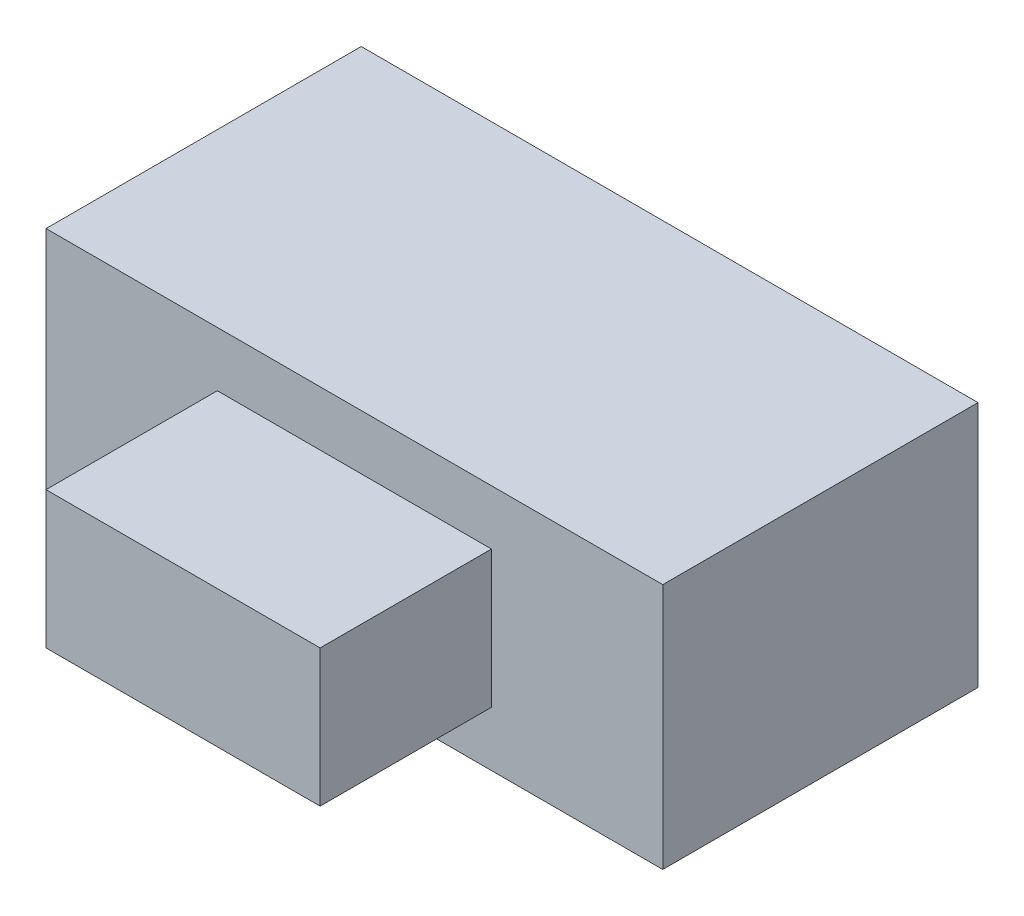
ISO-10303-21;
HEADER;
FILE_DESCRIPTION(('STEP AP214'),'2;1');
FILE_NAME('part.step','',(''),(''),'','','');
FILE_SCHEMA(('AUTOMOTIVE_DESIGN { 1 0 10303 214 1 1 1 1 }'));
ENDSEC;
DATA;
#1=APPLICATION_CONTEXT('core data for automotive mechanical design processes');
#2=APPLICATION_PROTOCOL_DEFINITION('international standard','automotive_design',2000,#1);
#3=PRODUCT_CONTEXT('',#1,'mechanical');
#4=PRODUCT('Part','Part','',(#3));
#5=PRODUCT_RELATED_PRODUCT_CATEGORY('part','',(#4));
#6=PRODUCT_DEFINITION_FORMATION('','',#4);
#7=PRODUCT_DEFINITION_CONTEXT('part definition',#1,'design');
#8=PRODUCT_DEFINITION('design','',#6,#7);
#9=PRODUCT_DEFINITION_SHAPE('','',#8);
#10=(LENGTH_UNIT() NAMED_UNIT(*) SI_UNIT(.MILLI.,.METRE.));
#11=(NAMED_UNIT(*) PLANE_ANGLE_UNIT() SI_UNIT($,.RADIAN.));
#12=(NAMED_UNIT(*) SI_UNIT($,.STERADIAN.) SOLID_ANGLE_UNIT());
#13=UNCERTAINTY_MEASURE_WITH_UNIT(LENGTH_MEASURE(1.E-05),#10,'distance_accuracy_value','');
#14=(GEOMETRIC_REPRESENTATION_CONTEXT(3) GLOBAL_UNCERTAINTY_ASSIGNED_CONTEXT((#13)) GLOBAL_UNIT_ASSIGNED_CONTEXT((#10,
#11,#12)) REPRESENTATION_CONTEXT('',''));
#15=CARTESIAN_POINT('',(0.,0.,0.));
#16=DIRECTION('',(0.,0.,1.));
#17=DIRECTION('',(1.,0.,0.));
#18=AXIS2_PLACEMENT_3D('',#15,#16,#17);
#19=CARTESIAN_POINT('',(2.25,1.8,1.15));
#20=DIRECTION('',(0.,0.,-1.));
#21=DIRECTION('',(-1.,0.,0.));
#22=AXIS2_PLACEMENT_3D('',#19,#20,#21);
#23=PLANE('',#22);
#24=DIRECTION('',(1.,0.,0.));
#25=VECTOR('',#24,1.);
#26=CARTESIAN_POINT('',(2.25,0.,1.15));
#27=LINE('',#26,#25);
#28=CARTESIAN_POINT('',(-2.25,0.,1.15));
#29=VERTEX_POINT('',#28);
#30=CARTESIAN_POINT('',(2.25,0.,1.15));
#31=VERTEX_POINT('',#30);
#32=EDGE_CURVE('E122',#29,#31,#27,.T.);
#33=ORIENTED_EDGE('',*,*,#32,.T.);
#34=DIRECTION('',(0.,-1.,0.));
#35=VECTOR('',#34,1.);
#36=CARTESIAN_POINT('',(2.25,1.8,1.15));
#37=LINE('',#36,#35);
#38=CARTESIAN_POINT('',(2.25,1.8,1.15));
#39=VERTEX_POINT('',#38);
#40=EDGE_CURVE('E41',#39,#31,#37,.T.);
#41=ORIENTED_EDGE('',*,*,#40,.F.);
#42=DIRECTION('',(1.,0.,0.));
#43=VECTOR('',#42,1.);
#44=CARTESIAN_POINT('',(2.25,1.8,1.15));
#45=LINE('',#44,#43);
#46=CARTESIAN_POINT('',(-2.25,1.8,1.15));
#47=VERTEX_POINT('',#46);
#48=EDGE_CURVE('E131',#47,#39,#45,.T.);
#49=ORIENTED_EDGE('',*,*,#48,.F.);
#50=DIRECTION('',(0.,-1.,0.));
#51=VECTOR('',#50,1.);
#52=CARTESIAN_POINT('',(-2.25,1.8,1.15));
#53=LINE('',#52,#51);
#54=EDGE_CURVE('E11',#47,#29,#53,.T.);
#55=ORIENTED_EDGE('',*,*,#54,.T.);
#56=EDGE_LOOP('',(#33,#41,#49,#55));
#57=FACE_BOUND('',#56,.T.);
#58=DIRECTION('',(0.,-1.,0.));
#59=VECTOR('',#58,1.);
#60=CARTESIAN_POINT('',(-1.,0.4,1.15));
#61=LINE('',#60,#59);
#62=CARTESIAN_POINT('',(-1.,1.4,1.15));
#63=VERTEX_POINT('',#62);
#64=CARTESIAN_POINT('',(-1.,0.4,1.15));
#65=VERTEX_POINT('',#64);
#66=EDGE_CURVE('E118',#63,#65,#61,.T.);
#67=ORIENTED_EDGE('',*,*,#66,.F.);
#68=DIRECTION('',(-1.,0.,0.));
#69=VECTOR('',#68,1.);
#70=CARTESIAN_POINT('',(1.,1.4,1.15));
#71=LINE('',#70,#69);
#72=CARTESIAN_POINT('',(1.,1.4,1.15));
#73=VERTEX_POINT('',#72);
#74=EDGE_CURVE('E115',#73,#63,#71,.T.);
#75=ORIENTED_EDGE('',*,*,#74,.F.);
#76=DIRECTION('',(0.,1.,0.));
#77=VECTOR('',#76,1.);
#78=CARTESIAN_POINT('',(1.,0.4,1.15));
#79=LINE('',#78,#77);
#80=CARTESIAN_POINT('',(1.,0.4,1.15));
#81=VERTEX_POINT('',#80);
#82=EDGE_CURVE('E53',#81,#73,#79,.T.);
#83=ORIENTED_EDGE('',*,*,#82,.F.);
#84=DIRECTION('',(1.,0.,0.));
#85=VECTOR('',#84,1.);
#86=CARTESIAN_POINT('',(1.,0.4,1.15));
#87=LINE('',#86,#85);
#88=EDGE_CURVE('E48',#65,#81,#87,.T.);
#89=ORIENTED_EDGE('',*,*,#88,.F.);
#90=EDGE_LOOP('',(#67,#75,#83,#89));
#91=FACE_BOUND('',#90,.T.);
#92=ADVANCED_FACE('F33',(#57,#91),#23,.F.);
#93=CARTESIAN_POINT('',(-2.25,1.8,-1.15));
#94=DIRECTION('',(1.,0.,0.));
#95=DIRECTION('',(0.,0.,-1.));
#96=AXIS2_PLACEMENT_3D('',#93,#94,#95);
#97=PLANE('',#96);
#98=DIRECTION('',(0.,0.,1.));
#99=VECTOR('',#98,1.);
#100=CARTESIAN_POINT('',(-2.25,0.,-1.15));
#101=LINE('',#100,#99);
#102=CARTESIAN_POINT('',(-2.25,0.,-1.15));
#103=VERTEX_POINT('',#102);
#104=EDGE_CURVE('E119',#103,#29,#101,.T.);
#105=ORIENTED_EDGE('',*,*,#104,.T.);
#106=ORIENTED_EDGE('',*,*,#54,.F.);
#107=DIRECTION('',(0.,0.,1.));
#108=VECTOR('',#107,1.);
#109=CARTESIAN_POINT('',(-2.25,1.8,-1.15));
#110=LINE('',#109,#108);
#111=CARTESIAN_POINT('',(-2.25,1.8,-1.15));
#112=VERTEX_POINT('',#111);
#113=EDGE_CURVE('E128',#112,#47,#110,.T.);
#114=ORIENTED_EDGE('',*,*,#113,.F.);
#115=DIRECTION('',(0.,-1.,0.));
#116=VECTOR('',#115,1.);
#117=CARTESIAN_POINT('',(-2.25,1.8,-1.15));
#118=LINE('',#117,#116);
#119=EDGE_CURVE('E137',#112,#103,#118,.T.);
#120=ORIENTED_EDGE('',*,*,#119,.T.);
#121=EDGE_LOOP('',(#105,#106,#114,#120));
#122=FACE_BOUND('',#121,.T.);
#123=ADVANCED_FACE('F35',(#122),#97,.F.);
#124=CARTESIAN_POINT('',(2.25,1.8,-1.15));
#125=DIRECTION('',(-1.,0.,0.));
#126=DIRECTION('',(0.,0.,1.));
#127=AXIS2_PLACEMENT_3D('',#124,#125,#126);
#128=PLANE('',#127);
#129=DIRECTION('',(0.,0.,-1.));
#130=VECTOR('',#129,1.);
#131=CARTESIAN_POINT('',(2.25,0.,-1.15));
#132=LINE('',#131,#130);
#133=CARTESIAN_POINT('',(2.25,0.,-1.15));
#134=VERTEX_POINT('',#133);
#135=EDGE_CURVE('E140',#31,#134,#132,.T.);
#136=ORIENTED_EDGE('',*,*,#135,.T.);
#137=DIRECTION('',(0.,-1.,0.));
#138=VECTOR('',#137,1.);
#139=CARTESIAN_POINT('',(2.25,1.8,-1.15));
#140=LINE('',#139,#138);
#141=CARTESIAN_POINT('',(2.25,1.8,-1.15));
#142=VERTEX_POINT('',#141);
#143=EDGE_CURVE('E145',#142,#134,#140,.T.);
#144=ORIENTED_EDGE('',*,*,#143,.F.);
#145=DIRECTION('',(0.,0.,-1.));
#146=VECTOR('',#145,1.);
#147=CARTESIAN_POINT('',(2.25,1.8,-1.15));
#148=LINE('',#147,#146);
#149=EDGE_CURVE('E134',#39,#142,#148,.T.);
#150=ORIENTED_EDGE('',*,*,#149,.F.);
#151=ORIENTED_EDGE('',*,*,#40,.T.);
#152=EDGE_LOOP('',(#136,#144,#150,#151));
#153=FACE_BOUND('',#152,.T.);
#154=ADVANCED_FACE('F152',(#153),#128,.F.);
#155=CARTESIAN_POINT('',(2.25,1.8,-1.15));
#156=DIRECTION('',(0.,0.,1.));
#157=DIRECTION('',(1.,0.,0.));
#158=AXIS2_PLACEMENT_3D('',#155,#156,#157);
#159=PLANE('',#158);
#160=DIRECTION('',(-1.,0.,0.));
#161=VECTOR('',#160,1.);
#162=CARTESIAN_POINT('',(2.25,0.,-1.15));
#163=LINE('',#162,#161);
#164=EDGE_CURVE('E132',#134,#103,#163,.T.);
#165=ORIENTED_EDGE('',*,*,#164,.T.);
#166=ORIENTED_EDGE('',*,*,#119,.F.);
#167=DIRECTION('',(-1.,0.,0.));
#168=VECTOR('',#167,1.);
#169=CARTESIAN_POINT('',(2.25,1.8,-1.15));
#170=LINE('',#169,#168);
#171=EDGE_CURVE('E136',#142,#112,#170,.T.);
#172=ORIENTED_EDGE('',*,*,#171,.F.);
#173=ORIENTED_EDGE('',*,*,#143,.T.);
#174=EDGE_LOOP('',(#165,#166,#172,#173));
#175=FACE_BOUND('',#174,.T.);
#176=ADVANCED_FACE('F161',(#175),#159,.F.);
#177=CARTESIAN_POINT('',(0.,1.8,0.));
#178=DIRECTION('',(0.,-1.,0.));
#179=DIRECTION('',(0.,0.,-1.));
#180=AXIS2_PLACEMENT_3D('',#177,#178,#179);
#181=PLANE('',#180);
#182=ORIENTED_EDGE('',*,*,#113,.T.);
#183=ORIENTED_EDGE('',*,*,#48,.T.);
#184=ORIENTED_EDGE('',*,*,#149,.T.);
#185=ORIENTED_EDGE('',*,*,#171,.T.);
#186=EDGE_LOOP('',(#182,#183,#184,#185));
#187=FACE_BOUND('',#186,.T.);
#188=ADVANCED_FACE('F167',(#187),#181,.F.);
#189=CARTESIAN_POINT('',(0.,0.,0.));
#190=DIRECTION('',(0.,-1.,0.));
#191=DIRECTION('',(0.,0.,-1.));
#192=AXIS2_PLACEMENT_3D('',#189,#190,#191);
#193=PLANE('',#192);
#194=ORIENTED_EDGE('',*,*,#104,.F.);
#195=ORIENTED_EDGE('',*,*,#164,.F.);
#196=ORIENTED_EDGE('',*,*,#135,.F.);
#197=ORIENTED_EDGE('',*,*,#32,.F.);
#198=EDGE_LOOP('',(#194,#195,#196,#197));
#199=FACE_BOUND('',#198,.T.);
#200=ADVANCED_FACE('F158',(#199),#193,.T.);
#201=CARTESIAN_POINT('',(-1.,0.4,2.4));
#202=DIRECTION('',(1.,0.,0.));
#203=DIRECTION('',(0.,0.,-1.));
#204=AXIS2_PLACEMENT_3D('',#201,#202,#203);
#205=PLANE('',#204);
#206=ORIENTED_EDGE('',*,*,#66,.T.);
#207=DIRECTION('',(0.,0.,-1.));
#208=VECTOR('',#207,1.);
#209=CARTESIAN_POINT('',(-1.,0.4,2.4));
#210=LINE('',#209,#208);
#211=CARTESIAN_POINT('',(-1.,0.4,2.4));
#212=VERTEX_POINT('',#211);
#213=EDGE_CURVE('E99',#212,#65,#210,.T.);
#214=ORIENTED_EDGE('',*,*,#213,.F.);
#215=DIRECTION('',(0.,-1.,0.));
#216=VECTOR('',#215,1.);
#217=CARTESIAN_POINT('',(-1.,0.4,2.4));
#218=LINE('',#217,#216);
#219=CARTESIAN_POINT('',(-1.,1.4,2.4));
#220=VERTEX_POINT('',#219);
#221=EDGE_CURVE('E106',#220,#212,#218,.T.);
#222=ORIENTED_EDGE('',*,*,#221,.F.);
#223=DIRECTION('',(0.,0.,-1.));
#224=VECTOR('',#223,1.);
#225=CARTESIAN_POINT('',(-1.,1.4,2.4));
#226=LINE('',#225,#224);
#227=EDGE_CURVE('E174',#220,#63,#226,.T.);
#228=ORIENTED_EDGE('',*,*,#227,.T.);
#229=EDGE_LOOP('',(#206,#214,#222,#228));
#230=FACE_BOUND('',#229,.T.);
#231=ADVANCED_FACE('F117',(#230),#205,.F.);
#232=CARTESIAN_POINT('',(1.,0.4,2.4));
#233=DIRECTION('',(0.,1.,0.));
#234=DIRECTION('',(-1.,0.,0.));
#235=AXIS2_PLACEMENT_3D('',#232,#233,#234);
#236=PLANE('',#235);
#237=ORIENTED_EDGE('',*,*,#88,.T.);
#238=DIRECTION('',(0.,0.,-1.));
#239=VECTOR('',#238,1.);
#240=CARTESIAN_POINT('',(1.,0.4,2.4));
#241=LINE('',#240,#239);
#242=CARTESIAN_POINT('',(1.,0.4,2.4));
#243=VERTEX_POINT('',#242);
#244=EDGE_CURVE('E102',#243,#81,#241,.T.);
#245=ORIENTED_EDGE('',*,*,#244,.F.);
#246=DIRECTION('',(1.,0.,0.));
#247=VECTOR('',#246,1.);
#248=CARTESIAN_POINT('',(1.,0.4,2.4));
#249=LINE('',#248,#247);
#250=EDGE_CURVE('E95',#212,#243,#249,.T.);
#251=ORIENTED_EDGE('',*,*,#250,.F.);
#252=ORIENTED_EDGE('',*,*,#213,.T.);
#253=EDGE_LOOP('',(#237,#245,#251,#252));
#254=FACE_BOUND('',#253,.T.);
#255=ADVANCED_FACE('F97',(#254),#236,.F.);
#256=CARTESIAN_POINT('',(1.,0.4,2.4));
#257=DIRECTION('',(-1.,0.,0.));
#258=DIRECTION('',(0.,0.,1.));
#259=AXIS2_PLACEMENT_3D('',#256,#257,#258);
#260=PLANE('',#259);
#261=ORIENTED_EDGE('',*,*,#82,.T.);
#262=DIRECTION('',(0.,0.,-1.));
#263=VECTOR('',#262,1.);
#264=CARTESIAN_POINT('',(1.,1.4,2.4));
#265=LINE('',#264,#263);
#266=CARTESIAN_POINT('',(1.,1.4,2.4));
#267=VERTEX_POINT('',#266);
#268=EDGE_CURVE('E124',#267,#73,#265,.T.);
#269=ORIENTED_EDGE('',*,*,#268,.F.);
#270=DIRECTION('',(0.,1.,0.));
#271=VECTOR('',#270,1.);
#272=CARTESIAN_POINT('',(1.,0.4,2.4));
#273=LINE('',#272,#271);
#274=EDGE_CURVE('E105',#243,#267,#273,.T.);
#275=ORIENTED_EDGE('',*,*,#274,.F.);
#276=ORIENTED_EDGE('',*,*,#244,.T.);
#277=EDGE_LOOP('',(#261,#269,#275,#276));
#278=FACE_BOUND('',#277,.T.);
#279=ADVANCED_FACE('F183',(#278),#260,.F.);
#280=CARTESIAN_POINT('',(1.,1.4,2.4));
#281=DIRECTION('',(0.,-1.,0.));
#282=DIRECTION('',(0.,0.,-1.));
#283=AXIS2_PLACEMENT_3D('',#280,#281,#282);
#284=PLANE('',#283);
#285=ORIENTED_EDGE('',*,*,#74,.T.);
#286=ORIENTED_EDGE('',*,*,#227,.F.);
#287=DIRECTION('',(-1.,0.,0.));
#288=VECTOR('',#287,1.);
#289=CARTESIAN_POINT('',(1.,1.4,2.4));
#290=LINE('',#289,#288);
#291=EDGE_CURVE('E111',#267,#220,#290,.T.);
#292=ORIENTED_EDGE('',*,*,#291,.F.);
#293=ORIENTED_EDGE('',*,*,#268,.T.);
#294=EDGE_LOOP('',(#285,#286,#292,#293));
#295=FACE_BOUND('',#294,.T.);
#296=ADVANCED_FACE('F173',(#295),#284,.F.);
#297=CARTESIAN_POINT('',(0.,0.,2.4));
#298=DIRECTION('',(0.,0.,1.));
#299=DIRECTION('',(1.,0.,0.));
#300=AXIS2_PLACEMENT_3D('',#297,#298,#299);
#301=PLANE('',#300);
#302=ORIENTED_EDGE('',*,*,#221,.T.);
#303=ORIENTED_EDGE('',*,*,#250,.T.);
#304=ORIENTED_EDGE('',*,*,#274,.T.);
#305=ORIENTED_EDGE('',*,*,#291,.T.);
#306=EDGE_LOOP('',(#302,#303,#304,#305));
#307=FACE_BOUND('',#306,.T.);
#308=ADVANCED_FACE('F109',(#307),#301,.T.);
#309=CLOSED_SHELL('',(#92,#123,#154,#176,#188,#200,#231,#255,#279,#296,#308));
#310=MANIFOLD_SOLID_BREP('B2',#309);
#311=ADVANCED_BREP_SHAPE_REPRESENTATION('',(#18,#310),#14);
#312=SHAPE_DEFINITION_REPRESENTATION(#9,#311);
ENDSEC;
END-ISO-10303-21;
